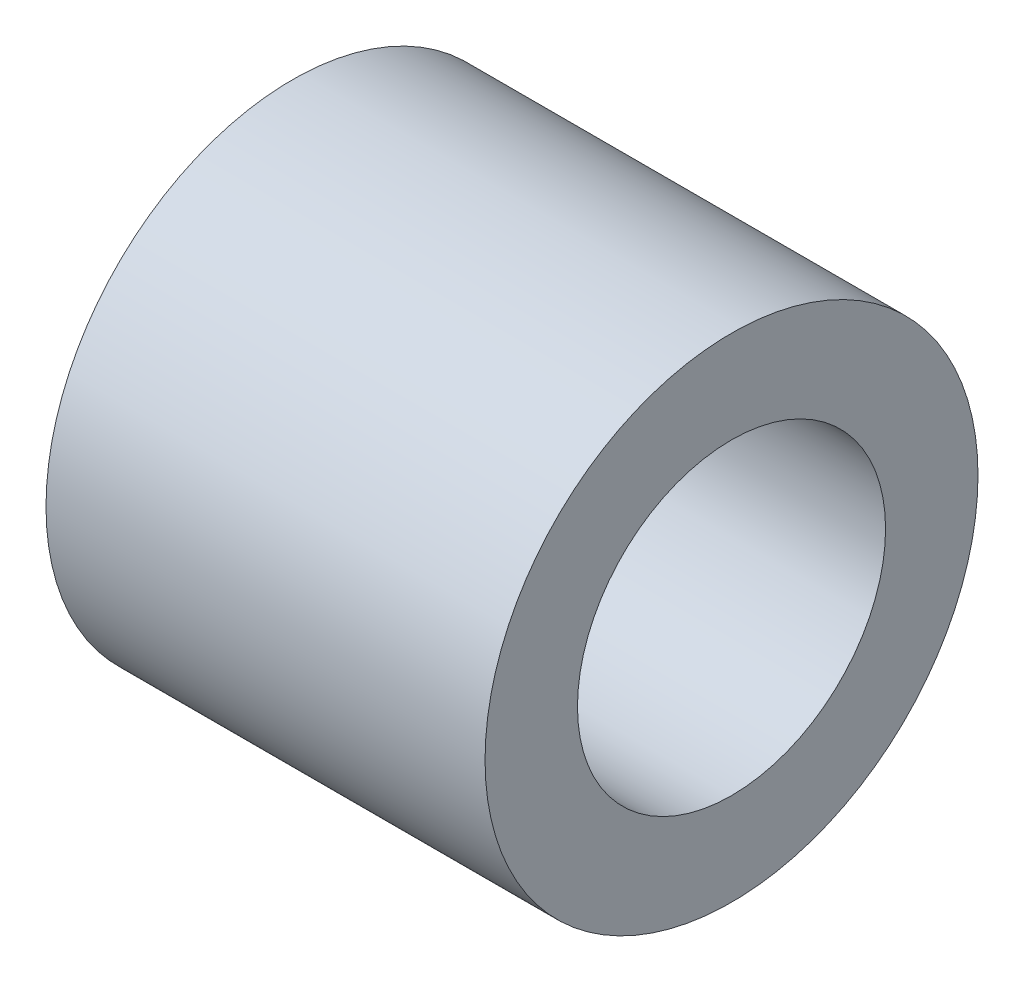
ISO-10303-21;
HEADER;
FILE_DESCRIPTION(('STEP AP214'),'2;1');
FILE_NAME('part.step','',(''),(''),'','','');
FILE_SCHEMA(('AUTOMOTIVE_DESIGN { 1 0 10303 214 1 1 1 1 }'));
ENDSEC;
DATA;
#1=APPLICATION_CONTEXT('core data for automotive mechanical design processes');
#2=APPLICATION_PROTOCOL_DEFINITION('international standard','automotive_design',2000,#1);
#3=PRODUCT_CONTEXT('',#1,'mechanical');
#4=PRODUCT('Part','Part','',(#3));
#5=PRODUCT_RELATED_PRODUCT_CATEGORY('part','',(#4));
#6=PRODUCT_DEFINITION_FORMATION('','',#4);
#7=PRODUCT_DEFINITION_CONTEXT('part definition',#1,'design');
#8=PRODUCT_DEFINITION('design','',#6,#7);
#9=PRODUCT_DEFINITION_SHAPE('','',#8);
#10=(LENGTH_UNIT() NAMED_UNIT(*) SI_UNIT(.MILLI.,.METRE.));
#11=(NAMED_UNIT(*) PLANE_ANGLE_UNIT() SI_UNIT($,.RADIAN.));
#12=(NAMED_UNIT(*) SI_UNIT($,.STERADIAN.) SOLID_ANGLE_UNIT());
#13=UNCERTAINTY_MEASURE_WITH_UNIT(LENGTH_MEASURE(1.E-05),#10,'distance_accuracy_value','');
#14=(GEOMETRIC_REPRESENTATION_CONTEXT(3) GLOBAL_UNCERTAINTY_ASSIGNED_CONTEXT((#13)) GLOBAL_UNIT_ASSIGNED_CONTEXT((#10,
#11,#12)) REPRESENTATION_CONTEXT('',''));
#15=CARTESIAN_POINT('',(0.,0.,0.));
#16=DIRECTION('',(0.,0.,1.));
#17=DIRECTION('',(1.,0.,0.));
#18=AXIS2_PLACEMENT_3D('',#15,#16,#17);
#19=CARTESIAN_POINT('',(1.,1.,0.));
#20=DIRECTION('',(1.,0.,0.));
#21=DIRECTION('',(0.,0.,-1.));
#22=AXIS2_PLACEMENT_3D('',#19,#20,#21);
#23=PLANE('',#22);
#24=CARTESIAN_POINT('',(0.999999999999999,0.,0.));
#25=DIRECTION('',(-1.,0.,0.));
#26=DIRECTION('',(0.,0.,1.));
#27=AXIS2_PLACEMENT_3D('',#24,#25,#26);
#28=CIRCLE('',#27,1.);
#29=CARTESIAN_POINT('',(0.999999999999999,0.,1.));
#30=VERTEX_POINT('',#29);
#31=EDGE_CURVE('E47',#30,#30,#28,.T.);
#32=ORIENTED_EDGE('',*,*,#31,.F.);
#33=EDGE_LOOP('',(#32));
#34=FACE_BOUND('',#33,.T.);
#35=CARTESIAN_POINT('',(1.,0.,0.));
#36=DIRECTION('',(-1.,0.,0.));
#37=DIRECTION('',(0.,0.,1.));
#38=AXIS2_PLACEMENT_3D('',#35,#36,#37);
#39=CIRCLE('',#38,1.6);
#40=CARTESIAN_POINT('',(1.,0.,1.6));
#41=VERTEX_POINT('',#40);
#42=EDGE_CURVE('E10',#41,#41,#39,.T.);
#43=ORIENTED_EDGE('',*,*,#42,.T.);
#44=EDGE_LOOP('',(#43));
#45=FACE_BOUND('',#44,.T.);
#46=ADVANCED_FACE('F33',(#34,#45),#23,.F.);
#47=CARTESIAN_POINT('',(0.,0.,0.));
#48=DIRECTION('',(-1.,0.,0.));
#49=DIRECTION('',(0.,0.,1.));
#50=AXIS2_PLACEMENT_3D('',#47,#48,#49);
#51=CYLINDRICAL_SURFACE('',#50,1.6);
#52=ORIENTED_EDGE('',*,*,#42,.F.);
#53=EDGE_LOOP('',(#52));
#54=FACE_BOUND('',#53,.T.);
#55=CARTESIAN_POINT('',(3.85,0.,0.));
#56=DIRECTION('',(-1.,0.,0.));
#57=DIRECTION('',(0.,0.,1.));
#58=AXIS2_PLACEMENT_3D('',#55,#56,#57);
#59=CIRCLE('',#58,1.6);
#60=CARTESIAN_POINT('',(3.85,0.,1.6));
#61=VERTEX_POINT('',#60);
#62=EDGE_CURVE('E39',#61,#61,#59,.T.);
#63=ORIENTED_EDGE('',*,*,#62,.T.);
#64=EDGE_LOOP('',(#63));
#65=FACE_BOUND('',#64,.T.);
#66=ADVANCED_FACE('F56',(#54,#65),#51,.T.);
#67=CARTESIAN_POINT('',(3.85,1.,0.));
#68=DIRECTION('',(-1.,0.,0.));
#69=DIRECTION('',(0.,0.,1.));
#70=AXIS2_PLACEMENT_3D('',#67,#68,#69);
#71=PLANE('',#70);
#72=ORIENTED_EDGE('',*,*,#62,.F.);
#73=EDGE_LOOP('',(#72));
#74=FACE_BOUND('',#73,.T.);
#75=CARTESIAN_POINT('',(3.85,0.,0.));
#76=DIRECTION('',(-1.,0.,0.));
#77=DIRECTION('',(0.,0.,1.));
#78=AXIS2_PLACEMENT_3D('',#75,#76,#77);
#79=CIRCLE('',#78,1.);
#80=CARTESIAN_POINT('',(3.85,0.,1.));
#81=VERTEX_POINT('',#80);
#82=EDGE_CURVE('E43',#81,#81,#79,.T.);
#83=ORIENTED_EDGE('',*,*,#82,.T.);
#84=EDGE_LOOP('',(#83));
#85=FACE_BOUND('',#84,.T.);
#86=ADVANCED_FACE('F60',(#74,#85),#71,.F.);
#87=CARTESIAN_POINT('',(0.,0.,0.));
#88=DIRECTION('',(-1.,0.,0.));
#89=DIRECTION('',(0.,0.,1.));
#90=AXIS2_PLACEMENT_3D('',#87,#88,#89);
#91=CYLINDRICAL_SURFACE('',#90,1.);
#92=ORIENTED_EDGE('',*,*,#82,.F.);
#93=EDGE_LOOP('',(#92));
#94=FACE_BOUND('',#93,.T.);
#95=ORIENTED_EDGE('',*,*,#31,.T.);
#96=EDGE_LOOP('',(#95));
#97=FACE_BOUND('',#96,.T.);
#98=ADVANCED_FACE('F53',(#94,#97),#91,.F.);
#99=CLOSED_SHELL('',(#46,#66,#86,#98));
#100=MANIFOLD_SOLID_BREP('B2',#99);
#101=ADVANCED_BREP_SHAPE_REPRESENTATION('',(#18,#100),#14);
#102=SHAPE_DEFINITION_REPRESENTATION(#9,#101);
ENDSEC;
END-ISO-10303-21;
